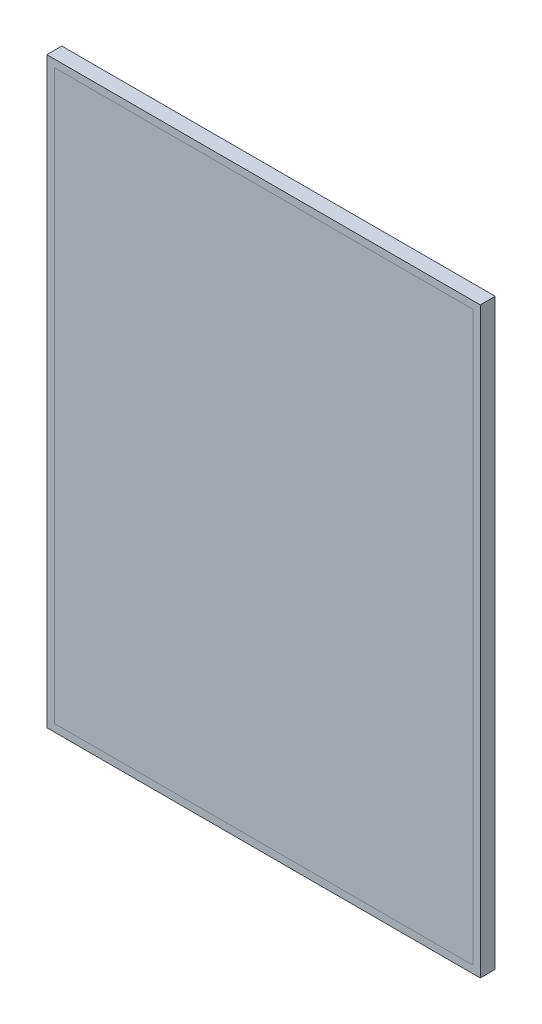
ISO-10303-21;
HEADER;
FILE_DESCRIPTION(('STEP AP214'),'2;1');
FILE_NAME('part.step','',(''),(''),'','','');
FILE_SCHEMA(('AUTOMOTIVE_DESIGN { 1 0 10303 214 1 1 1 1 }'));
ENDSEC;
DATA;
#1=APPLICATION_CONTEXT('core data for automotive mechanical design processes');
#2=APPLICATION_PROTOCOL_DEFINITION('international standard','automotive_design',2000,#1);
#3=PRODUCT_CONTEXT('',#1,'mechanical');
#4=PRODUCT('Part','Part','',(#3));
#5=PRODUCT_RELATED_PRODUCT_CATEGORY('part','',(#4));
#6=PRODUCT_DEFINITION_FORMATION('','',#4);
#7=PRODUCT_DEFINITION_CONTEXT('part definition',#1,'design');
#8=PRODUCT_DEFINITION('design','',#6,#7);
#9=PRODUCT_DEFINITION_SHAPE('','',#8);
#10=(LENGTH_UNIT() NAMED_UNIT(*) SI_UNIT(.MILLI.,.METRE.));
#11=(NAMED_UNIT(*) PLANE_ANGLE_UNIT() SI_UNIT($,.RADIAN.));
#12=(NAMED_UNIT(*) SI_UNIT($,.STERADIAN.) SOLID_ANGLE_UNIT());
#13=UNCERTAINTY_MEASURE_WITH_UNIT(LENGTH_MEASURE(1.E-05),#10,'distance_accuracy_value','');
#14=(GEOMETRIC_REPRESENTATION_CONTEXT(3) GLOBAL_UNCERTAINTY_ASSIGNED_CONTEXT((#13)) GLOBAL_UNIT_ASSIGNED_CONTEXT((#10,
#11,#12)) REPRESENTATION_CONTEXT('',''));
#15=CARTESIAN_POINT('',(0.,0.,0.));
#16=DIRECTION('',(0.,0.,1.));
#17=DIRECTION('',(1.,0.,0.));
#18=AXIS2_PLACEMENT_3D('',#15,#16,#17);
#19=CARTESIAN_POINT('',(140.,190.,9.));
#20=DIRECTION('',(1.,0.,0.));
#21=DIRECTION('',(0.,0.,-1.));
#22=AXIS2_PLACEMENT_3D('',#19,#20,#21);
#23=PLANE('',#22);
#24=DIRECTION('',(0.,1.,0.));
#25=VECTOR('',#24,1.);
#26=CARTESIAN_POINT('',(140.,190.,10.));
#27=LINE('',#26,#25);
#28=CARTESIAN_POINT('',(140.,-190.,10.));
#29=VERTEX_POINT('',#28);
#30=CARTESIAN_POINT('',(140.,190.,10.));
#31=VERTEX_POINT('',#30);
#32=EDGE_CURVE('E118',#29,#31,#27,.T.);
#33=ORIENTED_EDGE('',*,*,#32,.F.);
#34=DIRECTION('',(0.,0.,1.));
#35=VECTOR('',#34,1.);
#36=CARTESIAN_POINT('',(140.,-190.,9.));
#37=LINE('',#36,#35);
#38=CARTESIAN_POINT('',(140.,-190.,9.));
#39=VERTEX_POINT('',#38);
#40=EDGE_CURVE('E12',#39,#29,#37,.T.);
#41=ORIENTED_EDGE('',*,*,#40,.F.);
#42=DIRECTION('',(0.,1.,0.));
#43=VECTOR('',#42,1.);
#44=CARTESIAN_POINT('',(140.,190.,9.));
#45=LINE('',#44,#43);
#46=CARTESIAN_POINT('',(140.,190.,9.));
#47=VERTEX_POINT('',#46);
#48=EDGE_CURVE('E110',#39,#47,#45,.T.);
#49=ORIENTED_EDGE('',*,*,#48,.T.);
#50=DIRECTION('',(0.,0.,1.));
#51=VECTOR('',#50,1.);
#52=CARTESIAN_POINT('',(140.,190.,9.));
#53=LINE('',#52,#51);
#54=EDGE_CURVE('E51',#47,#31,#53,.T.);
#55=ORIENTED_EDGE('',*,*,#54,.T.);
#56=EDGE_LOOP('',(#33,#41,#49,#55));
#57=FACE_BOUND('',#56,.T.);
#58=ADVANCED_FACE('F48',(#57),#23,.T.);
#59=CARTESIAN_POINT('',(-140.,-190.,9.));
#60=DIRECTION('',(0.,-1.,0.));
#61=DIRECTION('',(0.,0.,-1.));
#62=AXIS2_PLACEMENT_3D('',#59,#60,#61);
#63=PLANE('',#62);
#64=DIRECTION('',(1.,0.,0.));
#65=VECTOR('',#64,1.);
#66=CARTESIAN_POINT('',(-140.,-190.,10.));
#67=LINE('',#66,#65);
#68=CARTESIAN_POINT('',(-140.,-190.,10.));
#69=VERTEX_POINT('',#68);
#70=EDGE_CURVE('E113',#69,#29,#67,.T.);
#71=ORIENTED_EDGE('',*,*,#70,.F.);
#72=DIRECTION('',(0.,0.,1.));
#73=VECTOR('',#72,1.);
#74=CARTESIAN_POINT('',(-140.,-190.,9.));
#75=LINE('',#74,#73);
#76=CARTESIAN_POINT('',(-140.,-190.,9.));
#77=VERTEX_POINT('',#76);
#78=EDGE_CURVE('E58',#77,#69,#75,.T.);
#79=ORIENTED_EDGE('',*,*,#78,.F.);
#80=DIRECTION('',(1.,0.,0.));
#81=VECTOR('',#80,1.);
#82=CARTESIAN_POINT('',(-140.,-190.,9.));
#83=LINE('',#82,#81);
#84=EDGE_CURVE('E105',#77,#39,#83,.T.);
#85=ORIENTED_EDGE('',*,*,#84,.T.);
#86=ORIENTED_EDGE('',*,*,#40,.T.);
#87=EDGE_LOOP('',(#71,#79,#85,#86));
#88=FACE_BOUND('',#87,.T.);
#89=ADVANCED_FACE('F134',(#88),#63,.T.);
#90=CARTESIAN_POINT('',(-140.,190.,9.));
#91=DIRECTION('',(-1.,0.,0.));
#92=DIRECTION('',(0.,0.,1.));
#93=AXIS2_PLACEMENT_3D('',#90,#91,#92);
#94=PLANE('',#93);
#95=DIRECTION('',(0.,-1.,0.));
#96=VECTOR('',#95,1.);
#97=CARTESIAN_POINT('',(-140.,190.,10.));
#98=LINE('',#97,#96);
#99=CARTESIAN_POINT('',(-140.,190.,10.));
#100=VERTEX_POINT('',#99);
#101=EDGE_CURVE('E99',#100,#69,#98,.T.);
#102=ORIENTED_EDGE('',*,*,#101,.F.);
#103=DIRECTION('',(0.,0.,1.));
#104=VECTOR('',#103,1.);
#105=CARTESIAN_POINT('',(-140.,190.,9.));
#106=LINE('',#105,#104);
#107=CARTESIAN_POINT('',(-140.,190.,9.));
#108=VERTEX_POINT('',#107);
#109=EDGE_CURVE('E94',#108,#100,#106,.T.);
#110=ORIENTED_EDGE('',*,*,#109,.F.);
#111=DIRECTION('',(0.,-1.,0.));
#112=VECTOR('',#111,1.);
#113=CARTESIAN_POINT('',(-140.,190.,9.));
#114=LINE('',#113,#112);
#115=EDGE_CURVE('E97',#108,#77,#114,.T.);
#116=ORIENTED_EDGE('',*,*,#115,.T.);
#117=ORIENTED_EDGE('',*,*,#78,.T.);
#118=EDGE_LOOP('',(#102,#110,#116,#117));
#119=FACE_BOUND('',#118,.T.);
#120=ADVANCED_FACE('F96',(#119),#94,.T.);
#121=CARTESIAN_POINT('',(-140.,190.,9.));
#122=DIRECTION('',(0.,1.,0.));
#123=DIRECTION('',(0.,0.,1.));
#124=AXIS2_PLACEMENT_3D('',#121,#122,#123);
#125=PLANE('',#124);
#126=DIRECTION('',(-1.,0.,0.));
#127=VECTOR('',#126,1.);
#128=CARTESIAN_POINT('',(-140.,190.,10.));
#129=LINE('',#128,#127);
#130=EDGE_CURVE('E122',#31,#100,#129,.T.);
#131=ORIENTED_EDGE('',*,*,#130,.F.);
#132=ORIENTED_EDGE('',*,*,#54,.F.);
#133=DIRECTION('',(-1.,0.,0.));
#134=VECTOR('',#133,1.);
#135=CARTESIAN_POINT('',(-140.,190.,9.));
#136=LINE('',#135,#134);
#137=EDGE_CURVE('E104',#47,#108,#136,.T.);
#138=ORIENTED_EDGE('',*,*,#137,.T.);
#139=ORIENTED_EDGE('',*,*,#109,.T.);
#140=EDGE_LOOP('',(#131,#132,#138,#139));
#141=FACE_BOUND('',#140,.T.);
#142=ADVANCED_FACE('F108',(#141),#125,.T.);
#143=CARTESIAN_POINT('',(0.,0.,9.));
#144=DIRECTION('',(0.,0.,1.));
#145=DIRECTION('',(1.,0.,0.));
#146=AXIS2_PLACEMENT_3D('',#143,#144,#145);
#147=PLANE('',#146);
#148=ORIENTED_EDGE('',*,*,#48,.F.);
#149=ORIENTED_EDGE('',*,*,#84,.F.);
#150=ORIENTED_EDGE('',*,*,#115,.F.);
#151=ORIENTED_EDGE('',*,*,#137,.F.);
#152=EDGE_LOOP('',(#148,#149,#150,#151));
#153=FACE_BOUND('',#152,.T.);
#154=ADVANCED_FACE('F103',(#153),#147,.F.);
#155=CARTESIAN_POINT('',(0.,0.,10.));
#156=DIRECTION('',(0.,0.,1.));
#157=DIRECTION('',(1.,0.,0.));
#158=AXIS2_PLACEMENT_3D('',#155,#156,#157);
#159=PLANE('',#158);
#160=ORIENTED_EDGE('',*,*,#32,.T.);
#161=ORIENTED_EDGE('',*,*,#130,.T.);
#162=ORIENTED_EDGE('',*,*,#101,.T.);
#163=ORIENTED_EDGE('',*,*,#70,.T.);
#164=EDGE_LOOP('',(#160,#161,#162,#163));
#165=FACE_BOUND('',#164,.T.);
#166=ADVANCED_FACE('F133',(#165),#159,.T.);
#167=CLOSED_SHELL('',(#58,#89,#120,#142,#154,#166));
#168=MANIFOLD_SOLID_BREP('B2',#167);
#169=CARTESIAN_POINT('',(0.,0.,10.));
#170=DIRECTION('',(0.,0.,1.));
#171=DIRECTION('',(1.,0.,0.));
#172=AXIS2_PLACEMENT_3D('',#169,#170,#171);
#173=PLANE('',#172);
#174=DIRECTION('',(0.,1.,0.));
#175=VECTOR('',#174,1.);
#176=CARTESIAN_POINT('',(145.,195.,10.));
#177=LINE('',#176,#175);
#178=CARTESIAN_POINT('',(145.,-195.,10.));
#179=VERTEX_POINT('',#178);
#180=CARTESIAN_POINT('',(145.,195.,10.));
#181=VERTEX_POINT('',#180);
#182=EDGE_CURVE('E284',#179,#181,#177,.T.);
#183=ORIENTED_EDGE('',*,*,#182,.T.);
#184=DIRECTION('',(-1.,0.,0.));
#185=VECTOR('',#184,1.);
#186=CARTESIAN_POINT('',(-145.,195.,10.));
#187=LINE('',#186,#185);
#188=CARTESIAN_POINT('',(-145.,195.,10.));
#189=VERTEX_POINT('',#188);
#190=EDGE_CURVE('E287',#181,#189,#187,.T.);
#191=ORIENTED_EDGE('',*,*,#190,.T.);
#192=DIRECTION('',(0.,-1.,0.));
#193=VECTOR('',#192,1.);
#194=CARTESIAN_POINT('',(-145.,195.,10.));
#195=LINE('',#194,#193);
#196=CARTESIAN_POINT('',(-145.,-195.,10.));
#197=VERTEX_POINT('',#196);
#198=EDGE_CURVE('E290',#189,#197,#195,.T.);
#199=ORIENTED_EDGE('',*,*,#198,.T.);
#200=DIRECTION('',(1.,0.,0.));
#201=VECTOR('',#200,1.);
#202=CARTESIAN_POINT('',(-145.,-195.,10.));
#203=LINE('',#202,#201);
#204=EDGE_CURVE('E292',#197,#179,#203,.T.);
#205=ORIENTED_EDGE('',*,*,#204,.T.);
#206=EDGE_LOOP('',(#183,#191,#199,#205));
#207=FACE_BOUND('',#206,.T.);
#208=DIRECTION('',(-1.,0.,0.));
#209=VECTOR('',#208,1.);
#210=CARTESIAN_POINT('',(-140.,190.,10.));
#211=LINE('',#210,#209);
#212=CARTESIAN_POINT('',(140.,190.,10.));
#213=VERTEX_POINT('',#212);
#214=CARTESIAN_POINT('',(-140.,190.,10.));
#215=VERTEX_POINT('',#214);
#216=EDGE_CURVE('E256',#213,#215,#211,.T.);
#217=ORIENTED_EDGE('',*,*,#216,.F.);
#218=DIRECTION('',(0.,1.,0.));
#219=VECTOR('',#218,1.);
#220=CARTESIAN_POINT('',(140.,190.,10.));
#221=LINE('',#220,#219);
#222=CARTESIAN_POINT('',(140.,-190.,10.));
#223=VERTEX_POINT('',#222);
#224=EDGE_CURVE('E248',#223,#213,#221,.T.);
#225=ORIENTED_EDGE('',*,*,#224,.F.);
#226=DIRECTION('',(1.,0.,0.));
#227=VECTOR('',#226,1.);
#228=CARTESIAN_POINT('',(-140.,-190.,10.));
#229=LINE('',#228,#227);
#230=CARTESIAN_POINT('',(-140.,-190.,10.));
#231=VERTEX_POINT('',#230);
#232=EDGE_CURVE('E270',#231,#223,#229,.T.);
#233=ORIENTED_EDGE('',*,*,#232,.F.);
#234=DIRECTION('',(0.,-1.,0.));
#235=VECTOR('',#234,1.);
#236=CARTESIAN_POINT('',(-140.,190.,10.));
#237=LINE('',#236,#235);
#238=EDGE_CURVE('E268',#215,#231,#237,.T.);
#239=ORIENTED_EDGE('',*,*,#238,.F.);
#240=EDGE_LOOP('',(#217,#225,#233,#239));
#241=FACE_BOUND('',#240,.T.);
#242=ADVANCED_FACE('F183',(#207,#241),#173,.T.);
#243=CARTESIAN_POINT('',(0.,0.,0.));
#244=DIRECTION('',(0.,0.,1.));
#245=DIRECTION('',(1.,0.,0.));
#246=AXIS2_PLACEMENT_3D('',#243,#244,#245);
#247=PLANE('',#246);
#248=DIRECTION('',(0.,1.,0.));
#249=VECTOR('',#248,1.);
#250=CARTESIAN_POINT('',(145.,195.,0.));
#251=LINE('',#250,#249);
#252=CARTESIAN_POINT('',(145.,-195.,0.));
#253=VERTEX_POINT('',#252);
#254=CARTESIAN_POINT('',(145.,195.,0.));
#255=VERTEX_POINT('',#254);
#256=EDGE_CURVE('E264',#253,#255,#251,.T.);
#257=ORIENTED_EDGE('',*,*,#256,.F.);
#258=DIRECTION('',(1.,0.,0.));
#259=VECTOR('',#258,1.);
#260=CARTESIAN_POINT('',(-145.,-195.,0.));
#261=LINE('',#260,#259);
#262=CARTESIAN_POINT('',(-145.,-195.,0.));
#263=VERTEX_POINT('',#262);
#264=EDGE_CURVE('E288',#263,#253,#261,.T.);
#265=ORIENTED_EDGE('',*,*,#264,.F.);
#266=DIRECTION('',(0.,-1.,0.));
#267=VECTOR('',#266,1.);
#268=CARTESIAN_POINT('',(-145.,195.,0.));
#269=LINE('',#268,#267);
#270=CARTESIAN_POINT('',(-145.,195.,0.));
#271=VERTEX_POINT('',#270);
#272=EDGE_CURVE('E299',#271,#263,#269,.T.);
#273=ORIENTED_EDGE('',*,*,#272,.F.);
#274=DIRECTION('',(-1.,0.,0.));
#275=VECTOR('',#274,1.);
#276=CARTESIAN_POINT('',(-145.,195.,0.));
#277=LINE('',#276,#275);
#278=EDGE_CURVE('E297',#255,#271,#277,.T.);
#279=ORIENTED_EDGE('',*,*,#278,.F.);
#280=EDGE_LOOP('',(#257,#265,#273,#279));
#281=FACE_BOUND('',#280,.T.);
#282=DIRECTION('',(0.,1.,0.));
#283=VECTOR('',#282,1.);
#284=CARTESIAN_POINT('',(140.,190.,0.));
#285=LINE('',#284,#283);
#286=CARTESIAN_POINT('',(140.,-190.,0.));
#287=VERTEX_POINT('',#286);
#288=CARTESIAN_POINT('',(140.,190.,0.));
#289=VERTEX_POINT('',#288);
#290=EDGE_CURVE('E206',#287,#289,#285,.T.);
#291=ORIENTED_EDGE('',*,*,#290,.T.);
#292=DIRECTION('',(-1.,0.,0.));
#293=VECTOR('',#292,1.);
#294=CARTESIAN_POINT('',(-140.,190.,0.));
#295=LINE('',#294,#293);
#296=CARTESIAN_POINT('',(-140.,190.,0.));
#297=VERTEX_POINT('',#296);
#298=EDGE_CURVE('E263',#289,#297,#295,.T.);
#299=ORIENTED_EDGE('',*,*,#298,.T.);
#300=DIRECTION('',(0.,-1.,0.));
#301=VECTOR('',#300,1.);
#302=CARTESIAN_POINT('',(-140.,190.,0.));
#303=LINE('',#302,#301);
#304=CARTESIAN_POINT('',(-140.,-190.,0.));
#305=VERTEX_POINT('',#304);
#306=EDGE_CURVE('E276',#297,#305,#303,.T.);
#307=ORIENTED_EDGE('',*,*,#306,.T.);
#308=DIRECTION('',(1.,0.,0.));
#309=VECTOR('',#308,1.);
#310=CARTESIAN_POINT('',(-140.,-190.,0.));
#311=LINE('',#310,#309);
#312=EDGE_CURVE('E257',#305,#287,#311,.T.);
#313=ORIENTED_EDGE('',*,*,#312,.T.);
#314=EDGE_LOOP('',(#291,#299,#307,#313));
#315=FACE_BOUND('',#314,.T.);
#316=ADVANCED_FACE('F317',(#281,#315),#247,.F.);
#317=CARTESIAN_POINT('',(145.,195.,10.));
#318=DIRECTION('',(-1.,0.,0.));
#319=DIRECTION('',(0.,-1.,0.));
#320=AXIS2_PLACEMENT_3D('',#317,#318,#319);
#321=PLANE('',#320);
#322=ORIENTED_EDGE('',*,*,#256,.T.);
#323=DIRECTION('',(0.,0.,-1.));
#324=VECTOR('',#323,1.);
#325=CARTESIAN_POINT('',(145.,195.,10.));
#326=LINE('',#325,#324);
#327=EDGE_CURVE('E46',#181,#255,#326,.T.);
#328=ORIENTED_EDGE('',*,*,#327,.F.);
#329=ORIENTED_EDGE('',*,*,#182,.F.);
#330=DIRECTION('',(0.,0.,-1.));
#331=VECTOR('',#330,1.);
#332=CARTESIAN_POINT('',(145.,-195.,10.));
#333=LINE('',#332,#331);
#334=EDGE_CURVE('E294',#179,#253,#333,.T.);
#335=ORIENTED_EDGE('',*,*,#334,.T.);
#336=EDGE_LOOP('',(#322,#328,#329,#335));
#337=FACE_BOUND('',#336,.T.);
#338=ADVANCED_FACE('F185',(#337),#321,.F.);
#339=CARTESIAN_POINT('',(-145.,195.,10.));
#340=DIRECTION('',(0.,-1.,0.));
#341=DIRECTION('',(0.,0.,-1.));
#342=AXIS2_PLACEMENT_3D('',#339,#340,#341);
#343=PLANE('',#342);
#344=ORIENTED_EDGE('',*,*,#278,.T.);
#345=DIRECTION('',(0.,0.,-1.));
#346=VECTOR('',#345,1.);
#347=CARTESIAN_POINT('',(-145.,195.,10.));
#348=LINE('',#347,#346);
#349=EDGE_CURVE('E191',#189,#271,#348,.T.);
#350=ORIENTED_EDGE('',*,*,#349,.F.);
#351=ORIENTED_EDGE('',*,*,#190,.F.);
#352=ORIENTED_EDGE('',*,*,#327,.T.);
#353=EDGE_LOOP('',(#344,#350,#351,#352));
#354=FACE_BOUND('',#353,.T.);
#355=ADVANCED_FACE('F327',(#354),#343,.F.);
#356=CARTESIAN_POINT('',(-145.,195.,10.));
#357=DIRECTION('',(1.,0.,0.));
#358=DIRECTION('',(0.,1.,0.));
#359=AXIS2_PLACEMENT_3D('',#356,#357,#358);
#360=PLANE('',#359);
#361=ORIENTED_EDGE('',*,*,#272,.T.);
#362=DIRECTION('',(0.,0.,-1.));
#363=VECTOR('',#362,1.);
#364=CARTESIAN_POINT('',(-145.,-195.,10.));
#365=LINE('',#364,#363);
#366=EDGE_CURVE('E304',#197,#263,#365,.T.);
#367=ORIENTED_EDGE('',*,*,#366,.F.);
#368=ORIENTED_EDGE('',*,*,#198,.F.);
#369=ORIENTED_EDGE('',*,*,#349,.T.);
#370=EDGE_LOOP('',(#361,#367,#368,#369));
#371=FACE_BOUND('',#370,.T.);
#372=ADVANCED_FACE('F311',(#371),#360,.F.);
#373=CARTESIAN_POINT('',(-145.,-195.,10.));
#374=DIRECTION('',(0.,1.,0.));
#375=DIRECTION('',(0.,0.,1.));
#376=AXIS2_PLACEMENT_3D('',#373,#374,#375);
#377=PLANE('',#376);
#378=ORIENTED_EDGE('',*,*,#264,.T.);
#379=ORIENTED_EDGE('',*,*,#334,.F.);
#380=ORIENTED_EDGE('',*,*,#204,.F.);
#381=ORIENTED_EDGE('',*,*,#366,.T.);
#382=EDGE_LOOP('',(#378,#379,#380,#381));
#383=FACE_BOUND('',#382,.T.);
#384=ADVANCED_FACE('F321',(#383),#377,.F.);
#385=CARTESIAN_POINT('',(140.,190.,10.));
#386=DIRECTION('',(-1.,0.,0.));
#387=DIRECTION('',(0.,-1.,0.));
#388=AXIS2_PLACEMENT_3D('',#385,#386,#387);
#389=PLANE('',#388);
#390=ORIENTED_EDGE('',*,*,#290,.F.);
#391=DIRECTION('',(0.,0.,-1.));
#392=VECTOR('',#391,1.);
#393=CARTESIAN_POINT('',(140.,-190.,10.));
#394=LINE('',#393,#392);
#395=EDGE_CURVE('E252',#223,#287,#394,.T.);
#396=ORIENTED_EDGE('',*,*,#395,.F.);
#397=ORIENTED_EDGE('',*,*,#224,.T.);
#398=DIRECTION('',(0.,0.,-1.));
#399=VECTOR('',#398,1.);
#400=CARTESIAN_POINT('',(140.,190.,10.));
#401=LINE('',#400,#399);
#402=EDGE_CURVE('E251',#213,#289,#401,.T.);
#403=ORIENTED_EDGE('',*,*,#402,.T.);
#404=EDGE_LOOP('',(#390,#396,#397,#403));
#405=FACE_BOUND('',#404,.T.);
#406=ADVANCED_FACE('F250',(#405),#389,.T.);
#407=CARTESIAN_POINT('',(-140.,190.,10.));
#408=DIRECTION('',(0.,-1.,0.));
#409=DIRECTION('',(0.,0.,-1.));
#410=AXIS2_PLACEMENT_3D('',#407,#408,#409);
#411=PLANE('',#410);
#412=ORIENTED_EDGE('',*,*,#298,.F.);
#413=ORIENTED_EDGE('',*,*,#402,.F.);
#414=ORIENTED_EDGE('',*,*,#216,.T.);
#415=DIRECTION('',(0.,0.,-1.));
#416=VECTOR('',#415,1.);
#417=CARTESIAN_POINT('',(-140.,190.,10.));
#418=LINE('',#417,#416);
#419=EDGE_CURVE('E265',#215,#297,#418,.T.);
#420=ORIENTED_EDGE('',*,*,#419,.T.);
#421=EDGE_LOOP('',(#412,#413,#414,#420));
#422=FACE_BOUND('',#421,.T.);
#423=ADVANCED_FACE('F260',(#422),#411,.T.);
#424=CARTESIAN_POINT('',(-140.,190.,10.));
#425=DIRECTION('',(1.,0.,0.));
#426=DIRECTION('',(0.,1.,0.));
#427=AXIS2_PLACEMENT_3D('',#424,#425,#426);
#428=PLANE('',#427);
#429=ORIENTED_EDGE('',*,*,#306,.F.);
#430=ORIENTED_EDGE('',*,*,#419,.F.);
#431=ORIENTED_EDGE('',*,*,#238,.T.);
#432=DIRECTION('',(0.,0.,-1.));
#433=VECTOR('',#432,1.);
#434=CARTESIAN_POINT('',(-140.,-190.,10.));
#435=LINE('',#434,#433);
#436=EDGE_CURVE('E198',#231,#305,#435,.T.);
#437=ORIENTED_EDGE('',*,*,#436,.T.);
#438=EDGE_LOOP('',(#429,#430,#431,#437));
#439=FACE_BOUND('',#438,.T.);
#440=ADVANCED_FACE('F350',(#439),#428,.T.);
#441=CARTESIAN_POINT('',(-140.,-190.,10.));
#442=DIRECTION('',(0.,1.,0.));
#443=DIRECTION('',(0.,0.,1.));
#444=AXIS2_PLACEMENT_3D('',#441,#442,#443);
#445=PLANE('',#444);
#446=ORIENTED_EDGE('',*,*,#312,.F.);
#447=ORIENTED_EDGE('',*,*,#436,.F.);
#448=ORIENTED_EDGE('',*,*,#232,.T.);
#449=ORIENTED_EDGE('',*,*,#395,.T.);
#450=EDGE_LOOP('',(#446,#447,#448,#449));
#451=FACE_BOUND('',#450,.T.);
#452=ADVANCED_FACE('F354',(#451),#445,.T.);
#453=CLOSED_SHELL('',(#242,#316,#338,#355,#372,#384,#406,#423,#440,#452));
#454=MANIFOLD_SOLID_BREP('B6',#453);
#455=ADVANCED_BREP_SHAPE_REPRESENTATION('',(#18,#168,#454),#14);
#456=SHAPE_DEFINITION_REPRESENTATION(#9,#455);
ENDSEC;
END-ISO-10303-21;
